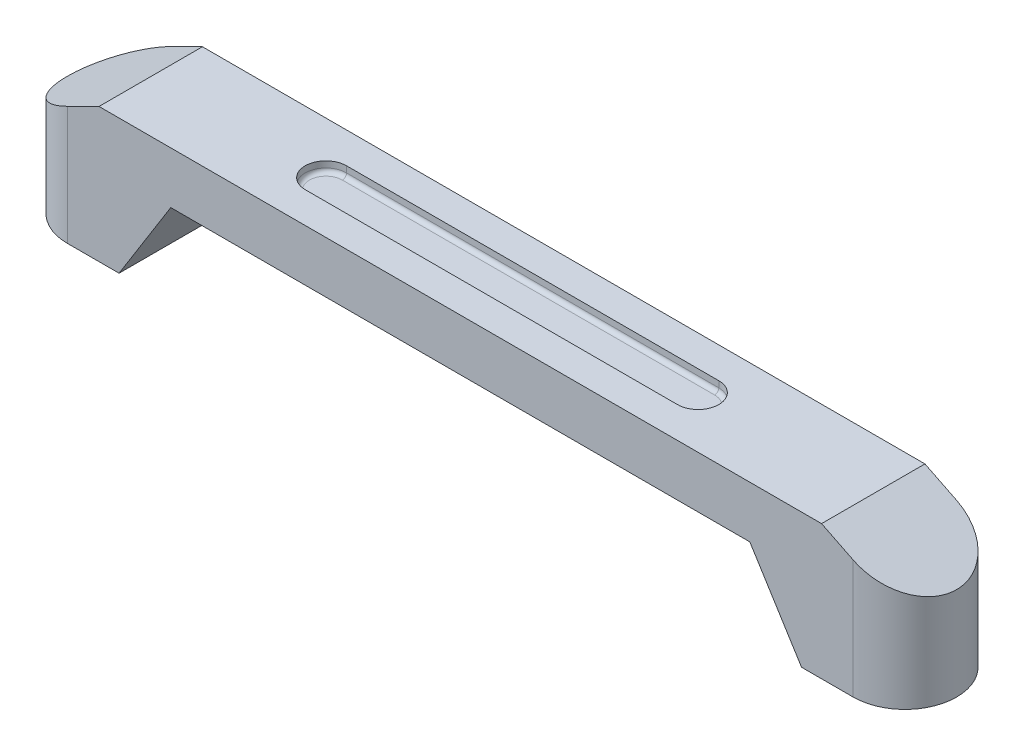
ISO-10303-21;
HEADER;
FILE_DESCRIPTION(('STEP AP214'),'2;1');
FILE_NAME('part.step','',(''),(''),'','','');
FILE_SCHEMA(('AUTOMOTIVE_DESIGN { 1 0 10303 214 1 1 1 1 }'));
ENDSEC;
DATA;
#1=APPLICATION_CONTEXT('core data for automotive mechanical design processes');
#2=APPLICATION_PROTOCOL_DEFINITION('international standard','automotive_design',2000,#1);
#3=PRODUCT_CONTEXT('',#1,'mechanical');
#4=PRODUCT('Part','Part','',(#3));
#5=PRODUCT_RELATED_PRODUCT_CATEGORY('part','',(#4));
#6=PRODUCT_DEFINITION_FORMATION('','',#4);
#7=PRODUCT_DEFINITION_CONTEXT('part definition',#1,'design');
#8=PRODUCT_DEFINITION('design','',#6,#7);
#9=PRODUCT_DEFINITION_SHAPE('','',#8);
#10=(LENGTH_UNIT() NAMED_UNIT(*) SI_UNIT(.MILLI.,.METRE.));
#11=(NAMED_UNIT(*) PLANE_ANGLE_UNIT() SI_UNIT($,.RADIAN.));
#12=(NAMED_UNIT(*) SI_UNIT($,.STERADIAN.) SOLID_ANGLE_UNIT());
#13=UNCERTAINTY_MEASURE_WITH_UNIT(LENGTH_MEASURE(1.E-05),#10,'distance_accuracy_value','');
#14=(GEOMETRIC_REPRESENTATION_CONTEXT(3) GLOBAL_UNCERTAINTY_ASSIGNED_CONTEXT((#13)) GLOBAL_UNIT_ASSIGNED_CONTEXT((#10,
#11,#12)) REPRESENTATION_CONTEXT('',''));
#15=CARTESIAN_POINT('',(0.,0.,0.));
#16=DIRECTION('',(0.,0.,1.));
#17=DIRECTION('',(1.,0.,0.));
#18=AXIS2_PLACEMENT_3D('',#15,#16,#17);
#19=CARTESIAN_POINT('',(-19.,0.,0.));
#20=DIRECTION('',(0.,1.,0.));
#21=DIRECTION('',(0.,0.,1.));
#22=AXIS2_PLACEMENT_3D('',#19,#20,#21);
#23=PLANE('',#22);
#24=CARTESIAN_POINT('',(18.75,0.,0.));
#25=DIRECTION('',(0.,-1.,0.));
#26=DIRECTION('',(0.,0.,-1.));
#27=AXIS2_PLACEMENT_3D('',#24,#25,#26);
#28=CIRCLE('',#27,1.);
#29=CARTESIAN_POINT('',(18.75,0.,-1.));
#30=VERTEX_POINT('',#29);
#31=EDGE_CURVE('E198',#30,#30,#28,.T.);
#32=ORIENTED_EDGE('',*,*,#31,.F.);
#33=EDGE_LOOP('',(#32));
#34=FACE_BOUND('',#33,.T.);
#35=DIRECTION('',(1.,0.,0.));
#36=VECTOR('',#35,1.);
#37=CARTESIAN_POINT('',(-19.,0.,2.5));
#38=LINE('',#37,#36);
#39=CARTESIAN_POINT('',(16.5,0.,2.5));
#40=VERTEX_POINT('',#39);
#41=CARTESIAN_POINT('',(19.,0.,2.49999999999999));
#42=VERTEX_POINT('',#41);
#43=EDGE_CURVE('E280',#40,#42,#38,.T.);
#44=ORIENTED_EDGE('',*,*,#43,.F.);
#45=DIRECTION('',(0.,0.,1.));
#46=VECTOR('',#45,1.);
#47=CARTESIAN_POINT('',(16.5,0.,-2.501));
#48=LINE('',#47,#46);
#49=CARTESIAN_POINT('',(16.5,0.,-2.49999999999999));
#50=VERTEX_POINT('',#49);
#51=EDGE_CURVE('E227',#50,#40,#48,.T.);
#52=ORIENTED_EDGE('',*,*,#51,.F.);
#53=DIRECTION('',(-1.,0.,0.));
#54=VECTOR('',#53,1.);
#55=CARTESIAN_POINT('',(-19.,0.,-2.49999999999999));
#56=LINE('',#55,#54);
#57=CARTESIAN_POINT('',(19.,0.,-2.49999999999999));
#58=VERTEX_POINT('',#57);
#59=EDGE_CURVE('E272',#58,#50,#56,.T.);
#60=ORIENTED_EDGE('',*,*,#59,.F.);
#61=CARTESIAN_POINT('',(19.,0.,0.));
#62=DIRECTION('',(0.,1.,0.));
#63=DIRECTION('',(0.,0.,1.));
#64=AXIS2_PLACEMENT_3D('',#61,#62,#63);
#65=CIRCLE('',#64,2.49999999999999);
#66=EDGE_CURVE('E285',#42,#58,#65,.T.);
#67=ORIENTED_EDGE('',*,*,#66,.F.);
#68=EDGE_LOOP('',(#44,#52,#60,#67));
#69=FACE_BOUND('',#68,.T.);
#70=ADVANCED_FACE('F43',(#34,#69),#23,.F.);
#71=CARTESIAN_POINT('',(-19.,6.5,0.));
#72=DIRECTION('',(0.,-1.,0.));
#73=DIRECTION('',(0.,0.,-1.));
#74=AXIS2_PLACEMENT_3D('',#71,#72,#73);
#75=CYLINDRICAL_SURFACE('',#74,2.49999999999999);
#76=DIRECTION('',(0.,-1.,0.));
#77=VECTOR('',#76,1.);
#78=CARTESIAN_POINT('',(-19.,6.5,2.5));
#79=LINE('',#78,#77);
#80=CARTESIAN_POINT('',(-19.,5.74034734589208,2.5));
#81=VERTEX_POINT('',#80);
#82=CARTESIAN_POINT('',(-19.,0.,2.5));
#83=VERTEX_POINT('',#82);
#84=EDGE_CURVE('E301',#81,#83,#79,.T.);
#85=ORIENTED_EDGE('',*,*,#84,.F.);
#86=CARTESIAN_POINT('',(-19.,5.74034734589208,0.));
#87=DIRECTION('',(0.444444444444445,-0.895806416477616,0.));
#88=DIRECTION('',(-0.895806416477616,-0.444444444444445,0.));
#89=AXIS2_PLACEMENT_3D('',#86,#87,#88);
#90=ELLIPSE('',#89,2.79078152825718,2.49999999999999);
#91=CARTESIAN_POINT('',(-19.,5.74034734589207,-2.49999999999999));
#92=VERTEX_POINT('',#91);
#93=EDGE_CURVE('E259',#92,#81,#90,.F.);
#94=ORIENTED_EDGE('',*,*,#93,.F.);
#95=DIRECTION('',(0.,-1.,0.));
#96=VECTOR('',#95,1.);
#97=CARTESIAN_POINT('',(-19.,6.5,-2.49999999999999));
#98=LINE('',#97,#96);
#99=CARTESIAN_POINT('',(-19.,0.,-2.49999999999999));
#100=VERTEX_POINT('',#99);
#101=EDGE_CURVE('E276',#92,#100,#98,.T.);
#102=ORIENTED_EDGE('',*,*,#101,.T.);
#103=CARTESIAN_POINT('',(-19.,0.,0.));
#104=DIRECTION('',(0.,1.,0.));
#105=DIRECTION('',(0.,0.,1.));
#106=AXIS2_PLACEMENT_3D('',#103,#104,#105);
#107=CIRCLE('',#106,2.49999999999999);
#108=EDGE_CURVE('E223',#100,#83,#107,.T.);
#109=ORIENTED_EDGE('',*,*,#108,.T.);
#110=EDGE_LOOP('',(#85,#94,#102,#109));
#111=FACE_BOUND('',#110,.T.);
#112=ADVANCED_FACE('F367',(#111),#75,.T.);
#113=CARTESIAN_POINT('',(-19.,6.5,2.5));
#114=DIRECTION('',(0.,0.,-1.));
#115=DIRECTION('',(-1.,0.,0.));
#116=AXIS2_PLACEMENT_3D('',#113,#114,#115);
#117=PLANE('',#116);
#118=DIRECTION('',(0.,-1.,0.));
#119=VECTOR('',#118,1.);
#120=CARTESIAN_POINT('',(19.,6.5,2.49999999999999));
#121=LINE('',#120,#119);
#122=CARTESIAN_POINT('',(19.,5.74034734589208,2.49999999999999));
#123=VERTEX_POINT('',#122);
#124=EDGE_CURVE('E298',#123,#42,#121,.T.);
#125=ORIENTED_EDGE('',*,*,#124,.F.);
#126=DIRECTION('',(0.895806416477616,-0.444444444444445,0.));
#127=VECTOR('',#126,1.);
#128=CARTESIAN_POINT('',(17.4688711258507,6.5,2.5));
#129=LINE('',#128,#127);
#130=CARTESIAN_POINT('',(17.4688711258507,6.5,2.5));
#131=VERTEX_POINT('',#130);
#132=EDGE_CURVE('E217',#131,#123,#129,.T.);
#133=ORIENTED_EDGE('',*,*,#132,.F.);
#134=DIRECTION('',(1.,0.,0.));
#135=VECTOR('',#134,1.);
#136=CARTESIAN_POINT('',(-19.,6.5,2.5));
#137=LINE('',#136,#135);
#138=CARTESIAN_POINT('',(-17.4688711258507,6.5,2.5));
#139=VERTEX_POINT('',#138);
#140=EDGE_CURVE('E267',#139,#131,#137,.T.);
#141=ORIENTED_EDGE('',*,*,#140,.F.);
#142=DIRECTION('',(0.895806416477616,0.444444444444445,0.));
#143=VECTOR('',#142,1.);
#144=CARTESIAN_POINT('',(-17.4688711258507,6.5,2.5));
#145=LINE('',#144,#143);
#146=EDGE_CURVE('E262',#81,#139,#145,.T.);
#147=ORIENTED_EDGE('',*,*,#146,.F.);
#148=ORIENTED_EDGE('',*,*,#84,.T.);
#149=CARTESIAN_POINT('',(-16.5,0.,2.5));
#150=VERTEX_POINT('',#149);
#151=EDGE_CURVE('E281',#83,#150,#38,.T.);
#152=ORIENTED_EDGE('',*,*,#151,.T.);
#153=DIRECTION('',(-0.52999894000318,-0.847998304005088,0.));
#154=VECTOR('',#153,1.);
#155=CARTESIAN_POINT('',(-14.,4.,2.5));
#156=LINE('',#155,#154);
#157=CARTESIAN_POINT('',(-14.,4.,2.5));
#158=VERTEX_POINT('',#157);
#159=EDGE_CURVE('E241',#158,#150,#156,.T.);
#160=ORIENTED_EDGE('',*,*,#159,.F.);
#161=DIRECTION('',(-1.,0.,0.));
#162=VECTOR('',#161,1.);
#163=CARTESIAN_POINT('',(-14.,4.,2.5));
#164=LINE('',#163,#162);
#165=CARTESIAN_POINT('',(14.,4.,2.5));
#166=VERTEX_POINT('',#165);
#167=EDGE_CURVE('E237',#166,#158,#164,.T.);
#168=ORIENTED_EDGE('',*,*,#167,.F.);
#169=DIRECTION('',(-0.52999894000318,0.847998304005088,0.));
#170=VECTOR('',#169,1.);
#171=CARTESIAN_POINT('',(14.,4.,2.5));
#172=LINE('',#171,#170);
#173=EDGE_CURVE('E244',#40,#166,#172,.T.);
#174=ORIENTED_EDGE('',*,*,#173,.F.);
#175=ORIENTED_EDGE('',*,*,#43,.T.);
#176=EDGE_LOOP('',(#125,#133,#141,#147,#148,#152,#160,#168,#174,#175));
#177=FACE_BOUND('',#176,.T.);
#178=ADVANCED_FACE('F374',(#177),#117,.F.);
#179=CARTESIAN_POINT('',(19.,6.5,0.));
#180=DIRECTION('',(0.,-1.,0.));
#181=DIRECTION('',(0.,0.,-1.));
#182=AXIS2_PLACEMENT_3D('',#179,#180,#181);
#183=CYLINDRICAL_SURFACE('',#182,2.49999999999999);
#184=DIRECTION('',(0.,-1.,0.));
#185=VECTOR('',#184,1.);
#186=CARTESIAN_POINT('',(19.,6.5,-2.49999999999999));
#187=LINE('',#186,#185);
#188=CARTESIAN_POINT('',(19.,5.74034734589208,-2.49999999999999));
#189=VERTEX_POINT('',#188);
#190=EDGE_CURVE('E295',#189,#58,#187,.T.);
#191=ORIENTED_EDGE('',*,*,#190,.F.);
#192=CARTESIAN_POINT('',(19.,5.74034734589208,0.));
#193=DIRECTION('',(-0.444444444444445,-0.895806416477616,0.));
#194=DIRECTION('',(0.895806416477616,-0.444444444444445,0.));
#195=AXIS2_PLACEMENT_3D('',#192,#193,#194);
#196=ELLIPSE('',#195,2.79078152825718,2.49999999999999);
#197=EDGE_CURVE('E213',#123,#189,#196,.F.);
#198=ORIENTED_EDGE('',*,*,#197,.F.);
#199=ORIENTED_EDGE('',*,*,#124,.T.);
#200=ORIENTED_EDGE('',*,*,#66,.T.);
#201=EDGE_LOOP('',(#191,#198,#199,#200));
#202=FACE_BOUND('',#201,.T.);
#203=ADVANCED_FACE('F416',(#202),#183,.T.);
#204=CARTESIAN_POINT('',(-19.,6.5,-2.49999999999999));
#205=DIRECTION('',(0.,0.,1.));
#206=DIRECTION('',(1.,0.,0.));
#207=AXIS2_PLACEMENT_3D('',#204,#205,#206);
#208=PLANE('',#207);
#209=DIRECTION('',(-1.,0.,0.));
#210=VECTOR('',#209,1.);
#211=CARTESIAN_POINT('',(-19.,6.5,-2.49999999999999));
#212=LINE('',#211,#210);
#213=CARTESIAN_POINT('',(17.4688711258507,6.5,-2.49999999999999));
#214=VERTEX_POINT('',#213);
#215=CARTESIAN_POINT('',(-17.4688711258507,6.5,-2.5));
#216=VERTEX_POINT('',#215);
#217=EDGE_CURVE('E271',#214,#216,#212,.T.);
#218=ORIENTED_EDGE('',*,*,#217,.F.);
#219=DIRECTION('',(-0.895806416477616,0.444444444444445,0.));
#220=VECTOR('',#219,1.);
#221=CARTESIAN_POINT('',(17.4688711258507,6.5,-2.49999999999999));
#222=LINE('',#221,#220);
#223=EDGE_CURVE('E220',#189,#214,#222,.T.);
#224=ORIENTED_EDGE('',*,*,#223,.F.);
#225=ORIENTED_EDGE('',*,*,#190,.T.);
#226=ORIENTED_EDGE('',*,*,#59,.T.);
#227=DIRECTION('',(0.52999894000318,-0.847998304005088,0.));
#228=VECTOR('',#227,1.);
#229=CARTESIAN_POINT('',(14.,4.,-2.49999999999999));
#230=LINE('',#229,#228);
#231=CARTESIAN_POINT('',(14.,4.,-2.49999999999999));
#232=VERTEX_POINT('',#231);
#233=EDGE_CURVE('E234',#232,#50,#230,.T.);
#234=ORIENTED_EDGE('',*,*,#233,.F.);
#235=DIRECTION('',(1.,0.,0.));
#236=VECTOR('',#235,1.);
#237=CARTESIAN_POINT('',(-14.,4.,-2.49999999999999));
#238=LINE('',#237,#236);
#239=CARTESIAN_POINT('',(-14.,4.,-2.49999999999999));
#240=VERTEX_POINT('',#239);
#241=EDGE_CURVE('E231',#240,#232,#238,.T.);
#242=ORIENTED_EDGE('',*,*,#241,.F.);
#243=DIRECTION('',(0.52999894000318,0.847998304005088,0.));
#244=VECTOR('',#243,1.);
#245=CARTESIAN_POINT('',(-14.,4.,-2.49999999999999));
#246=LINE('',#245,#244);
#247=CARTESIAN_POINT('',(-16.5,0.,-2.49999999999999));
#248=VERTEX_POINT('',#247);
#249=EDGE_CURVE('E214',#248,#240,#246,.T.);
#250=ORIENTED_EDGE('',*,*,#249,.F.);
#251=EDGE_CURVE('E289',#248,#100,#56,.T.);
#252=ORIENTED_EDGE('',*,*,#251,.T.);
#253=ORIENTED_EDGE('',*,*,#101,.F.);
#254=DIRECTION('',(-0.895806416477616,-0.444444444444445,0.));
#255=VECTOR('',#254,1.);
#256=CARTESIAN_POINT('',(-17.4688711258507,6.5,-2.49999999999999));
#257=LINE('',#256,#255);
#258=EDGE_CURVE('E228',#216,#92,#257,.T.);
#259=ORIENTED_EDGE('',*,*,#258,.F.);
#260=EDGE_LOOP('',(#218,#224,#225,#226,#234,#242,#250,#252,#253,#259));
#261=FACE_BOUND('',#260,.T.);
#262=ADVANCED_FACE('F391',(#261),#208,.F.);
#263=CARTESIAN_POINT('',(-19.,6.5,0.));
#264=DIRECTION('',(0.,1.,0.));
#265=DIRECTION('',(0.,0.,1.));
#266=AXIS2_PLACEMENT_3D('',#263,#264,#265);
#267=PLANE('',#266);
#268=CARTESIAN_POINT('',(-9.,6.5,0.));
#269=DIRECTION('',(0.,1.,0.));
#270=DIRECTION('',(0.,0.,1.));
#271=AXIS2_PLACEMENT_3D('',#268,#269,#270);
#272=CIRCLE('',#271,1.);
#273=CARTESIAN_POINT('',(-9.,6.5,-1.));
#274=VERTEX_POINT('',#273);
#275=CARTESIAN_POINT('',(-9.,6.5,1.));
#276=VERTEX_POINT('',#275);
#277=EDGE_CURVE('E173',#274,#276,#272,.T.);
#278=ORIENTED_EDGE('',*,*,#277,.F.);
#279=DIRECTION('',(-1.,0.,0.));
#280=VECTOR('',#279,1.);
#281=CARTESIAN_POINT('',(-9.,6.5,-1.));
#282=LINE('',#281,#280);
#283=CARTESIAN_POINT('',(9.,6.5,-1.));
#284=VERTEX_POINT('',#283);
#285=EDGE_CURVE('E178',#284,#274,#282,.T.);
#286=ORIENTED_EDGE('',*,*,#285,.F.);
#287=CARTESIAN_POINT('',(9.,6.5,0.));
#288=DIRECTION('',(0.,1.,0.));
#289=DIRECTION('',(0.,0.,1.));
#290=AXIS2_PLACEMENT_3D('',#287,#288,#289);
#291=CIRCLE('',#290,1.);
#292=CARTESIAN_POINT('',(9.,6.5,0.999999999999997));
#293=VERTEX_POINT('',#292);
#294=EDGE_CURVE('E160',#293,#284,#291,.T.);
#295=ORIENTED_EDGE('',*,*,#294,.F.);
#296=DIRECTION('',(1.,0.,0.));
#297=VECTOR('',#296,1.);
#298=CARTESIAN_POINT('',(-9.,6.5,1.));
#299=LINE('',#298,#297);
#300=EDGE_CURVE('E167',#276,#293,#299,.T.);
#301=ORIENTED_EDGE('',*,*,#300,.F.);
#302=EDGE_LOOP('',(#278,#286,#295,#301));
#303=FACE_BOUND('',#302,.T.);
#304=DIRECTION('',(0.,0.,-1.));
#305=VECTOR('',#304,1.);
#306=CARTESIAN_POINT('',(17.4688711258507,6.5,-2.501));
#307=LINE('',#306,#305);
#308=EDGE_CURVE('E209',#131,#214,#307,.T.);
#309=ORIENTED_EDGE('',*,*,#308,.T.);
#310=ORIENTED_EDGE('',*,*,#217,.T.);
#311=DIRECTION('',(0.,0.,1.));
#312=VECTOR('',#311,1.);
#313=CARTESIAN_POINT('',(-17.4688711258507,6.5,-2.501));
#314=LINE('',#313,#312);
#315=EDGE_CURVE('E197',#216,#139,#314,.T.);
#316=ORIENTED_EDGE('',*,*,#315,.T.);
#317=ORIENTED_EDGE('',*,*,#140,.T.);
#318=EDGE_LOOP('',(#309,#310,#316,#317));
#319=FACE_BOUND('',#318,.T.);
#320=ADVANCED_FACE('F175',(#303,#319),#267,.T.);
#321=CARTESIAN_POINT('',(-18.75,0.,0.));
#322=DIRECTION('',(0.,-1.,0.));
#323=DIRECTION('',(0.,0.,1.));
#324=AXIS2_PLACEMENT_3D('',#321,#322,#323);
#325=CIRCLE('',#324,1.);
#326=CARTESIAN_POINT('',(-18.75,0.,0.999999999999998));
#327=VERTEX_POINT('',#326);
#328=EDGE_CURVE('E188',#327,#327,#325,.T.);
#329=ORIENTED_EDGE('',*,*,#328,.F.);
#330=EDGE_LOOP('',(#329));
#331=FACE_BOUND('',#330,.T.);
#332=ORIENTED_EDGE('',*,*,#251,.F.);
#333=DIRECTION('',(0.,0.,-1.));
#334=VECTOR('',#333,1.);
#335=CARTESIAN_POINT('',(-16.5,0.,-2.501));
#336=LINE('',#335,#334);
#337=EDGE_CURVE('E224',#150,#248,#336,.T.);
#338=ORIENTED_EDGE('',*,*,#337,.F.);
#339=ORIENTED_EDGE('',*,*,#151,.F.);
#340=ORIENTED_EDGE('',*,*,#108,.F.);
#341=EDGE_LOOP('',(#332,#338,#339,#340));
#342=FACE_BOUND('',#341,.T.);
#343=ADVANCED_FACE('F370',(#331,#342),#23,.F.);
#344=CARTESIAN_POINT('',(-14.,4.,-2.501));
#345=DIRECTION('',(0.,1.,0.));
#346=DIRECTION('',(-1.,0.,0.));
#347=AXIS2_PLACEMENT_3D('',#344,#345,#346);
#348=PLANE('',#347);
#349=ORIENTED_EDGE('',*,*,#241,.T.);
#350=DIRECTION('',(0.,0.,1.));
#351=VECTOR('',#350,1.);
#352=CARTESIAN_POINT('',(14.,4.,-2.501));
#353=LINE('',#352,#351);
#354=EDGE_CURVE('E249',#232,#166,#353,.T.);
#355=ORIENTED_EDGE('',*,*,#354,.T.);
#356=ORIENTED_EDGE('',*,*,#167,.T.);
#357=DIRECTION('',(0.,0.,1.));
#358=VECTOR('',#357,1.);
#359=CARTESIAN_POINT('',(-14.,4.,-2.501));
#360=LINE('',#359,#358);
#361=EDGE_CURVE('E248',#240,#158,#360,.T.);
#362=ORIENTED_EDGE('',*,*,#361,.F.);
#363=EDGE_LOOP('',(#349,#355,#356,#362));
#364=FACE_BOUND('',#363,.T.);
#365=ADVANCED_FACE('F382',(#364),#348,.F.);
#366=CARTESIAN_POINT('',(14.,4.,-2.501));
#367=DIRECTION('',(0.847998304005088,0.52999894000318,0.));
#368=DIRECTION('',(-0.52999894000318,0.847998304005088,0.));
#369=AXIS2_PLACEMENT_3D('',#366,#367,#368);
#370=PLANE('',#369);
#371=ORIENTED_EDGE('',*,*,#233,.T.);
#372=ORIENTED_EDGE('',*,*,#51,.T.);
#373=ORIENTED_EDGE('',*,*,#173,.T.);
#374=ORIENTED_EDGE('',*,*,#354,.F.);
#375=EDGE_LOOP('',(#371,#372,#373,#374));
#376=FACE_BOUND('',#375,.T.);
#377=ADVANCED_FACE('F388',(#376),#370,.F.);
#378=CARTESIAN_POINT('',(-14.,4.,-2.501));
#379=DIRECTION('',(-0.847998304005088,0.52999894000318,0.));
#380=DIRECTION('',(-0.52999894000318,-0.847998304005088,0.));
#381=AXIS2_PLACEMENT_3D('',#378,#379,#380);
#382=PLANE('',#381);
#383=ORIENTED_EDGE('',*,*,#249,.T.);
#384=ORIENTED_EDGE('',*,*,#361,.T.);
#385=ORIENTED_EDGE('',*,*,#159,.T.);
#386=ORIENTED_EDGE('',*,*,#337,.T.);
#387=EDGE_LOOP('',(#383,#384,#385,#386));
#388=FACE_BOUND('',#387,.T.);
#389=ADVANCED_FACE('F430',(#388),#382,.F.);
#390=CARTESIAN_POINT('',(-17.4688711258507,6.5,-2.501));
#391=DIRECTION('',(0.444444444444445,-0.895806416477616,0.));
#392=DIRECTION('',(0.895806416477617,0.444444444444445,0.));
#393=AXIS2_PLACEMENT_3D('',#390,#391,#392);
#394=PLANE('',#393);
#395=ORIENTED_EDGE('',*,*,#93,.T.);
#396=ORIENTED_EDGE('',*,*,#146,.T.);
#397=ORIENTED_EDGE('',*,*,#315,.F.);
#398=ORIENTED_EDGE('',*,*,#258,.T.);
#399=EDGE_LOOP('',(#395,#396,#397,#398));
#400=FACE_BOUND('',#399,.T.);
#401=ADVANCED_FACE('F428',(#400),#394,.F.);
#402=CARTESIAN_POINT('',(17.4688711258507,6.5,-2.501));
#403=DIRECTION('',(-0.444444444444445,-0.895806416477616,0.));
#404=DIRECTION('',(0.895806416477617,-0.444444444444445,0.));
#405=AXIS2_PLACEMENT_3D('',#402,#403,#404);
#406=PLANE('',#405);
#407=ORIENTED_EDGE('',*,*,#197,.T.);
#408=ORIENTED_EDGE('',*,*,#223,.T.);
#409=ORIENTED_EDGE('',*,*,#308,.F.);
#410=ORIENTED_EDGE('',*,*,#132,.T.);
#411=EDGE_LOOP('',(#407,#408,#409,#410));
#412=FACE_BOUND('',#411,.T.);
#413=ADVANCED_FACE('F420',(#412),#406,.F.);
#414=CARTESIAN_POINT('',(-18.75,3.5,0.));
#415=DIRECTION('',(0.,-1.,0.));
#416=DIRECTION('',(0.,0.,-1.));
#417=AXIS2_PLACEMENT_3D('',#414,#415,#416);
#418=CYLINDRICAL_SURFACE('',#417,1.);
#419=CARTESIAN_POINT('',(-18.75,3.5,0.));
#420=DIRECTION('',(0.,-1.,0.));
#421=DIRECTION('',(0.,0.,1.));
#422=AXIS2_PLACEMENT_3D('',#419,#420,#421);
#423=CIRCLE('',#422,1.);
#424=CARTESIAN_POINT('',(-18.75,3.5,0.999999999999998));
#425=VERTEX_POINT('',#424);
#426=EDGE_CURVE('E202',#425,#425,#423,.T.);
#427=ORIENTED_EDGE('',*,*,#426,.F.);
#428=EDGE_LOOP('',(#427));
#429=FACE_BOUND('',#428,.T.);
#430=ORIENTED_EDGE('',*,*,#328,.T.);
#431=EDGE_LOOP('',(#430));
#432=FACE_BOUND('',#431,.T.);
#433=ADVANCED_FACE('F436',(#429,#432),#418,.F.);
#434=CARTESIAN_POINT('',(-18.75,3.5,0.));
#435=DIRECTION('',(0.,1.,0.));
#436=DIRECTION('',(0.,0.,1.));
#437=AXIS2_PLACEMENT_3D('',#434,#435,#436);
#438=PLANE('',#437);
#439=ORIENTED_EDGE('',*,*,#426,.T.);
#440=EDGE_LOOP('',(#439));
#441=FACE_BOUND('',#440,.T.);
#442=ADVANCED_FACE('F446',(#441),#438,.F.);
#443=CARTESIAN_POINT('',(18.75,3.5,0.));
#444=DIRECTION('',(0.,-1.,0.));
#445=DIRECTION('',(0.,0.,-1.));
#446=AXIS2_PLACEMENT_3D('',#443,#444,#445);
#447=CYLINDRICAL_SURFACE('',#446,1.);
#448=CARTESIAN_POINT('',(18.75,3.5,0.));
#449=DIRECTION('',(0.,-1.,0.));
#450=DIRECTION('',(0.,0.,-1.));
#451=AXIS2_PLACEMENT_3D('',#448,#449,#450);
#452=CIRCLE('',#451,1.);
#453=CARTESIAN_POINT('',(18.75,3.5,-1.));
#454=VERTEX_POINT('',#453);
#455=EDGE_CURVE('E193',#454,#454,#452,.T.);
#456=ORIENTED_EDGE('',*,*,#455,.F.);
#457=EDGE_LOOP('',(#456));
#458=FACE_BOUND('',#457,.T.);
#459=ORIENTED_EDGE('',*,*,#31,.T.);
#460=EDGE_LOOP('',(#459));
#461=FACE_BOUND('',#460,.T.);
#462=ADVANCED_FACE('F450',(#458,#461),#447,.F.);
#463=CARTESIAN_POINT('',(18.75,3.5,0.));
#464=DIRECTION('',(0.,-1.,0.));
#465=DIRECTION('',(0.,0.,-1.));
#466=AXIS2_PLACEMENT_3D('',#463,#464,#465);
#467=PLANE('',#466);
#468=ORIENTED_EDGE('',*,*,#455,.T.);
#469=EDGE_LOOP('',(#468));
#470=FACE_BOUND('',#469,.T.);
#471=ADVANCED_FACE('F454',(#470),#467,.T.);
#472=CARTESIAN_POINT('',(-9.,6.,0.));
#473=DIRECTION('',(0.,1.,0.));
#474=DIRECTION('',(0.,0.,1.));
#475=AXIS2_PLACEMENT_3D('',#472,#473,#474);
#476=CYLINDRICAL_SURFACE('',#475,1.);
#477=DIRECTION('',(0.,1.,0.));
#478=VECTOR('',#477,1.);
#479=CARTESIAN_POINT('',(-9.,6.,1.));
#480=LINE('',#479,#478);
#481=CARTESIAN_POINT('',(-9.,6.2,1.));
#482=VERTEX_POINT('',#481);
#483=EDGE_CURVE('E164',#482,#276,#480,.T.);
#484=ORIENTED_EDGE('',*,*,#483,.F.);
#485=CARTESIAN_POINT('',(-9.,6.2,0.));
#486=DIRECTION('',(0.,1.,0.));
#487=DIRECTION('',(0.,0.,1.));
#488=AXIS2_PLACEMENT_3D('',#485,#486,#487);
#489=CIRCLE('',#488,1.);
#490=CARTESIAN_POINT('',(-9.,6.2,-1.));
#491=VERTEX_POINT('',#490);
#492=EDGE_CURVE('E11',#482,#491,#489,.F.);
#493=ORIENTED_EDGE('',*,*,#492,.T.);
#494=DIRECTION('',(0.,1.,0.));
#495=VECTOR('',#494,1.);
#496=CARTESIAN_POINT('',(-9.,6.,-1.));
#497=LINE('',#496,#495);
#498=EDGE_CURVE('E185',#491,#274,#497,.T.);
#499=ORIENTED_EDGE('',*,*,#498,.T.);
#500=ORIENTED_EDGE('',*,*,#277,.T.);
#501=EDGE_LOOP('',(#484,#493,#499,#500));
#502=FACE_BOUND('',#501,.T.);
#503=ADVANCED_FACE('F344',(#502),#476,.F.);
#504=CARTESIAN_POINT('',(-9.,6.,-1.));
#505=DIRECTION('',(0.,0.,-1.));
#506=DIRECTION('',(-1.,0.,0.));
#507=AXIS2_PLACEMENT_3D('',#504,#505,#506);
#508=PLANE('',#507);
#509=ORIENTED_EDGE('',*,*,#498,.F.);
#510=DIRECTION('',(-1.,0.,0.));
#511=VECTOR('',#510,1.);
#512=CARTESIAN_POINT('',(-9.,6.2,-1.));
#513=LINE('',#512,#511);
#514=CARTESIAN_POINT('',(9.,6.2,-1.));
#515=VERTEX_POINT('',#514);
#516=EDGE_CURVE('E317',#491,#515,#513,.F.);
#517=ORIENTED_EDGE('',*,*,#516,.T.);
#518=DIRECTION('',(0.,1.,0.));
#519=VECTOR('',#518,1.);
#520=CARTESIAN_POINT('',(9.,6.,-1.));
#521=LINE('',#520,#519);
#522=EDGE_CURVE('E163',#515,#284,#521,.T.);
#523=ORIENTED_EDGE('',*,*,#522,.T.);
#524=ORIENTED_EDGE('',*,*,#285,.T.);
#525=EDGE_LOOP('',(#509,#517,#523,#524));
#526=FACE_BOUND('',#525,.T.);
#527=ADVANCED_FACE('F348',(#526),#508,.F.);
#528=CARTESIAN_POINT('',(9.,6.,0.));
#529=DIRECTION('',(0.,1.,0.));
#530=DIRECTION('',(0.,0.,1.));
#531=AXIS2_PLACEMENT_3D('',#528,#529,#530);
#532=CYLINDRICAL_SURFACE('',#531,1.);
#533=ORIENTED_EDGE('',*,*,#522,.F.);
#534=CARTESIAN_POINT('',(9.,6.2,0.));
#535=DIRECTION('',(0.,1.,0.));
#536=DIRECTION('',(0.,0.,1.));
#537=AXIS2_PLACEMENT_3D('',#534,#535,#536);
#538=CIRCLE('',#537,1.);
#539=CARTESIAN_POINT('',(9.,6.2,0.999999999999997));
#540=VERTEX_POINT('',#539);
#541=EDGE_CURVE('E68',#515,#540,#538,.F.);
#542=ORIENTED_EDGE('',*,*,#541,.T.);
#543=DIRECTION('',(0.,1.,0.));
#544=VECTOR('',#543,1.);
#545=CARTESIAN_POINT('',(9.,6.,0.999999999999997));
#546=LINE('',#545,#544);
#547=EDGE_CURVE('E156',#540,#293,#546,.T.);
#548=ORIENTED_EDGE('',*,*,#547,.T.);
#549=ORIENTED_EDGE('',*,*,#294,.T.);
#550=EDGE_LOOP('',(#533,#542,#548,#549));
#551=FACE_BOUND('',#550,.T.);
#552=ADVANCED_FACE('F158',(#551),#532,.F.);
#553=CARTESIAN_POINT('',(-9.,6.,1.));
#554=DIRECTION('',(0.,0.,1.));
#555=DIRECTION('',(1.,0.,0.));
#556=AXIS2_PLACEMENT_3D('',#553,#554,#555);
#557=PLANE('',#556);
#558=ORIENTED_EDGE('',*,*,#547,.F.);
#559=DIRECTION('',(1.,0.,0.));
#560=VECTOR('',#559,1.);
#561=CARTESIAN_POINT('',(-9.,6.2,1.));
#562=LINE('',#561,#560);
#563=EDGE_CURVE('E53',#540,#482,#562,.F.);
#564=ORIENTED_EDGE('',*,*,#563,.T.);
#565=ORIENTED_EDGE('',*,*,#483,.T.);
#566=ORIENTED_EDGE('',*,*,#300,.T.);
#567=EDGE_LOOP('',(#558,#564,#565,#566));
#568=FACE_BOUND('',#567,.T.);
#569=ADVANCED_FACE('F168',(#568),#557,.F.);
#570=CARTESIAN_POINT('',(-9.,6.,0.));
#571=DIRECTION('',(0.,1.,0.));
#572=DIRECTION('',(0.,0.,1.));
#573=AXIS2_PLACEMENT_3D('',#570,#571,#572);
#574=PLANE('',#573);
#575=CARTESIAN_POINT('',(9.,6.,0.));
#576=DIRECTION('',(0.,1.,0.));
#577=DIRECTION('',(0.,0.,1.));
#578=AXIS2_PLACEMENT_3D('',#575,#576,#577);
#579=CIRCLE('',#578,0.8);
#580=CARTESIAN_POINT('',(9.,6.,0.799999999999997));
#581=VERTEX_POINT('',#580);
#582=CARTESIAN_POINT('',(9.,6.,-0.800000000000003));
#583=VERTEX_POINT('',#582);
#584=EDGE_CURVE('E310',#581,#583,#579,.T.);
#585=ORIENTED_EDGE('',*,*,#584,.T.);
#586=DIRECTION('',(-1.,0.,0.));
#587=VECTOR('',#586,1.);
#588=CARTESIAN_POINT('',(-9.,6.,-0.8));
#589=LINE('',#588,#587);
#590=CARTESIAN_POINT('',(-9.,6.,-0.8));
#591=VERTEX_POINT('',#590);
#592=EDGE_CURVE('E313',#583,#591,#589,.T.);
#593=ORIENTED_EDGE('',*,*,#592,.T.);
#594=CARTESIAN_POINT('',(-9.,6.,0.));
#595=DIRECTION('',(0.,1.,0.));
#596=DIRECTION('',(0.,0.,1.));
#597=AXIS2_PLACEMENT_3D('',#594,#595,#596);
#598=CIRCLE('',#597,0.8);
#599=CARTESIAN_POINT('',(-9.,6.,0.8));
#600=VERTEX_POINT('',#599);
#601=EDGE_CURVE('E304',#591,#600,#598,.T.);
#602=ORIENTED_EDGE('',*,*,#601,.T.);
#603=DIRECTION('',(1.,0.,0.));
#604=VECTOR('',#603,1.);
#605=CARTESIAN_POINT('',(-9.,6.,0.8));
#606=LINE('',#605,#604);
#607=EDGE_CURVE('E307',#600,#581,#606,.T.);
#608=ORIENTED_EDGE('',*,*,#607,.T.);
#609=EDGE_LOOP('',(#585,#593,#602,#608));
#610=FACE_BOUND('',#609,.T.);
#611=ADVANCED_FACE('F357',(#610),#574,.T.);
#612=CARTESIAN_POINT('',(-9.,6.2,0.8));
#613=DIRECTION('',(1.,0.,0.));
#614=DIRECTION('',(0.,0.,-1.));
#615=AXIS2_PLACEMENT_3D('',#612,#613,#614);
#616=CYLINDRICAL_SURFACE('',#615,0.2);
#617=CARTESIAN_POINT('',(-9.,6.2,0.8));
#618=DIRECTION('',(1.,0.,0.));
#619=DIRECTION('',(0.,0.,-1.));
#620=AXIS2_PLACEMENT_3D('',#617,#618,#619);
#621=CIRCLE('',#620,0.2);
#622=EDGE_CURVE('E330',#482,#600,#621,.T.);
#623=ORIENTED_EDGE('',*,*,#622,.F.);
#624=ORIENTED_EDGE('',*,*,#563,.F.);
#625=CARTESIAN_POINT('',(9.,6.2,0.799999999999997));
#626=DIRECTION('',(-1.,0.,0.));
#627=DIRECTION('',(0.,0.,1.));
#628=AXIS2_PLACEMENT_3D('',#625,#626,#627);
#629=CIRCLE('',#628,0.2);
#630=EDGE_CURVE('E47',#581,#540,#629,.T.);
#631=ORIENTED_EDGE('',*,*,#630,.F.);
#632=ORIENTED_EDGE('',*,*,#607,.F.);
#633=EDGE_LOOP('',(#623,#624,#631,#632));
#634=FACE_BOUND('',#633,.T.);
#635=ADVANCED_FACE('F45',(#634),#616,.F.);
#636=CARTESIAN_POINT('',(9.,6.2,0.));
#637=DIRECTION('',(0.,1.,0.));
#638=DIRECTION('',(0.,0.,1.));
#639=AXIS2_PLACEMENT_3D('',#636,#637,#638);
#640=TOROIDAL_SURFACE('',#639,0.8,0.2);
#641=ORIENTED_EDGE('',*,*,#630,.T.);
#642=ORIENTED_EDGE('',*,*,#541,.F.);
#643=CARTESIAN_POINT('',(9.,6.2,-0.800000000000003));
#644=DIRECTION('',(1.,0.,0.));
#645=DIRECTION('',(0.,0.,-1.));
#646=AXIS2_PLACEMENT_3D('',#643,#644,#645);
#647=CIRCLE('',#646,0.2);
#648=EDGE_CURVE('E328',#583,#515,#647,.T.);
#649=ORIENTED_EDGE('',*,*,#648,.F.);
#650=ORIENTED_EDGE('',*,*,#584,.F.);
#651=EDGE_LOOP('',(#641,#642,#649,#650));
#652=FACE_BOUND('',#651,.T.);
#653=ADVANCED_FACE('F358',(#652),#640,.F.);
#654=CARTESIAN_POINT('',(-9.,6.2,0.));
#655=DIRECTION('',(0.,1.,0.));
#656=DIRECTION('',(0.,0.,1.));
#657=AXIS2_PLACEMENT_3D('',#654,#655,#656);
#658=TOROIDAL_SURFACE('',#657,0.8,0.2);
#659=ORIENTED_EDGE('',*,*,#622,.T.);
#660=ORIENTED_EDGE('',*,*,#601,.F.);
#661=CARTESIAN_POINT('',(-9.,6.2,-0.8));
#662=DIRECTION('',(-1.,0.,0.));
#663=DIRECTION('',(0.,0.,1.));
#664=AXIS2_PLACEMENT_3D('',#661,#662,#663);
#665=CIRCLE('',#664,0.2);
#666=EDGE_CURVE('E325',#491,#591,#665,.T.);
#667=ORIENTED_EDGE('',*,*,#666,.F.);
#668=ORIENTED_EDGE('',*,*,#492,.F.);
#669=EDGE_LOOP('',(#659,#660,#667,#668));
#670=FACE_BOUND('',#669,.T.);
#671=ADVANCED_FACE('F354',(#670),#658,.F.);
#672=CARTESIAN_POINT('',(-9.,6.2,-0.8));
#673=DIRECTION('',(-1.,0.,0.));
#674=DIRECTION('',(0.,0.,1.));
#675=AXIS2_PLACEMENT_3D('',#672,#673,#674);
#676=CYLINDRICAL_SURFACE('',#675,0.2);
#677=ORIENTED_EDGE('',*,*,#648,.T.);
#678=ORIENTED_EDGE('',*,*,#516,.F.);
#679=ORIENTED_EDGE('',*,*,#666,.T.);
#680=ORIENTED_EDGE('',*,*,#592,.F.);
#681=EDGE_LOOP('',(#677,#678,#679,#680));
#682=FACE_BOUND('',#681,.T.);
#683=ADVANCED_FACE('F351',(#682),#676,.F.);
#684=CLOSED_SHELL('',(#70,#112,#178,#203,#262,#320,#343,#365,#377,#389,#401,#413,#433,#442,#462,
#471,#503,#527,#552,#569,#611,#635,#653,#671,#683));
#685=MANIFOLD_SOLID_BREP('B2',#684);
#686=ADVANCED_BREP_SHAPE_REPRESENTATION('',(#18,#685),#14);
#687=SHAPE_DEFINITION_REPRESENTATION(#9,#686);
ENDSEC;
END-ISO-10303-21;
